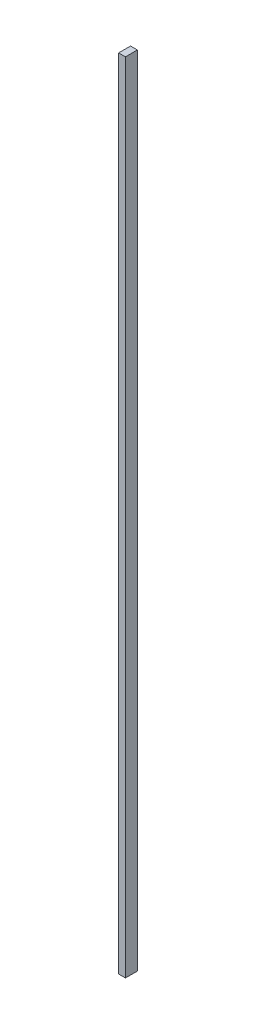
ISO-10303-21;
HEADER;
FILE_DESCRIPTION(('STEP AP214'),'2;1');
FILE_NAME('part.step','',(''),(''),'','','');
FILE_SCHEMA(('AUTOMOTIVE_DESIGN { 1 0 10303 214 1 1 1 1 }'));
ENDSEC;
DATA;
#1=APPLICATION_CONTEXT('core data for automotive mechanical design processes');
#2=APPLICATION_PROTOCOL_DEFINITION('international standard','automotive_design',2000,#1);
#3=PRODUCT_CONTEXT('',#1,'mechanical');
#4=PRODUCT('Part','Part','',(#3));
#5=PRODUCT_RELATED_PRODUCT_CATEGORY('part','',(#4));
#6=PRODUCT_DEFINITION_FORMATION('','',#4);
#7=PRODUCT_DEFINITION_CONTEXT('part definition',#1,'design');
#8=PRODUCT_DEFINITION('design','',#6,#7);
#9=PRODUCT_DEFINITION_SHAPE('','',#8);
#10=(LENGTH_UNIT() NAMED_UNIT(*) SI_UNIT(.MILLI.,.METRE.));
#11=(NAMED_UNIT(*) PLANE_ANGLE_UNIT() SI_UNIT($,.RADIAN.));
#12=(NAMED_UNIT(*) SI_UNIT($,.STERADIAN.) SOLID_ANGLE_UNIT());
#13=UNCERTAINTY_MEASURE_WITH_UNIT(LENGTH_MEASURE(1.E-05),#10,'distance_accuracy_value','');
#14=(GEOMETRIC_REPRESENTATION_CONTEXT(3) GLOBAL_UNCERTAINTY_ASSIGNED_CONTEXT((#13)) GLOBAL_UNIT_ASSIGNED_CONTEXT((#10,
#11,#12)) REPRESENTATION_CONTEXT('',''));
#15=CARTESIAN_POINT('',(0.,0.,0.));
#16=DIRECTION('',(0.,0.,1.));
#17=DIRECTION('',(1.,0.,0.));
#18=AXIS2_PLACEMENT_3D('',#15,#16,#17);
#19=CARTESIAN_POINT('',(124.,117.085786437627,-117.085786437627));
#20=DIRECTION('',(0.,0.,-1.));
#21=DIRECTION('',(0.,1.,0.));
#22=AXIS2_PLACEMENT_3D('',#19,#20,#21);
#23=PLANE('',#22);
#24=DIRECTION('',(0.,-1.,0.));
#25=VECTOR('',#24,1.);
#26=CARTESIAN_POINT('',(122.,117.085786437627,-117.085786437627));
#27=LINE('',#26,#25);
#28=CARTESIAN_POINT('',(122.,117.085786437627,-117.085786437627));
#29=VERTEX_POINT('',#28);
#30=CARTESIAN_POINT('',(122.,-117.085786437627,-117.085786437627));
#31=VERTEX_POINT('',#30);
#32=EDGE_CURVE('E107',#29,#31,#27,.T.);
#33=ORIENTED_EDGE('',*,*,#32,.T.);
#34=DIRECTION('',(-1.,0.,0.));
#35=VECTOR('',#34,1.);
#36=CARTESIAN_POINT('',(124.,-117.085786437627,-117.085786437627));
#37=LINE('',#36,#35);
#38=CARTESIAN_POINT('',(124.,-117.085786437627,-117.085786437627));
#39=VERTEX_POINT('',#38);
#40=EDGE_CURVE('E11',#39,#31,#37,.T.);
#41=ORIENTED_EDGE('',*,*,#40,.F.);
#42=DIRECTION('',(0.,-1.,0.));
#43=VECTOR('',#42,1.);
#44=CARTESIAN_POINT('',(124.,117.085786437627,-117.085786437627));
#45=LINE('',#44,#43);
#46=CARTESIAN_POINT('',(124.,117.085786437627,-117.085786437627));
#47=VERTEX_POINT('',#46);
#48=EDGE_CURVE('E91',#47,#39,#45,.T.);
#49=ORIENTED_EDGE('',*,*,#48,.F.);
#50=DIRECTION('',(-1.,0.,0.));
#51=VECTOR('',#50,1.);
#52=CARTESIAN_POINT('',(124.,117.085786437627,-117.085786437627));
#53=LINE('',#52,#51);
#54=EDGE_CURVE('E103',#47,#29,#53,.T.);
#55=ORIENTED_EDGE('',*,*,#54,.T.);
#56=EDGE_LOOP('',(#33,#41,#49,#55));
#57=FACE_BOUND('',#56,.T.);
#58=ADVANCED_FACE('F39',(#57),#23,.F.);
#59=CARTESIAN_POINT('',(124.,-117.085786437627,-117.085786437627));
#60=DIRECTION('',(0.,1.,0.));
#61=DIRECTION('',(0.,0.,1.));
#62=AXIS2_PLACEMENT_3D('',#59,#60,#61);
#63=PLANE('',#62);
#64=DIRECTION('',(0.,0.,-1.));
#65=VECTOR('',#64,1.);
#66=CARTESIAN_POINT('',(122.,-117.085786437627,-117.085786437627));
#67=LINE('',#66,#65);
#68=CARTESIAN_POINT('',(122.,-117.085786437627,-120.585786437627));
#69=VERTEX_POINT('',#68);
#70=EDGE_CURVE('E96',#31,#69,#67,.T.);
#71=ORIENTED_EDGE('',*,*,#70,.T.);
#72=DIRECTION('',(-1.,0.,0.));
#73=VECTOR('',#72,1.);
#74=CARTESIAN_POINT('',(124.,-117.085786437627,-120.585786437627));
#75=LINE('',#74,#73);
#76=CARTESIAN_POINT('',(124.,-117.085786437627,-120.585786437627));
#77=VERTEX_POINT('',#76);
#78=EDGE_CURVE('E48',#77,#69,#75,.T.);
#79=ORIENTED_EDGE('',*,*,#78,.F.);
#80=DIRECTION('',(0.,0.,-1.));
#81=VECTOR('',#80,1.);
#82=CARTESIAN_POINT('',(124.,-117.085786437627,-117.085786437627));
#83=LINE('',#82,#81);
#84=EDGE_CURVE('E86',#39,#77,#83,.T.);
#85=ORIENTED_EDGE('',*,*,#84,.F.);
#86=ORIENTED_EDGE('',*,*,#40,.T.);
#87=EDGE_LOOP('',(#71,#79,#85,#86));
#88=FACE_BOUND('',#87,.T.);
#89=ADVANCED_FACE('F95',(#88),#63,.F.);
#90=CARTESIAN_POINT('',(124.,117.085786437627,-120.585786437627));
#91=DIRECTION('',(0.,0.,1.));
#92=DIRECTION('',(0.,-1.,0.));
#93=AXIS2_PLACEMENT_3D('',#90,#91,#92);
#94=PLANE('',#93);
#95=DIRECTION('',(0.,1.,0.));
#96=VECTOR('',#95,1.);
#97=CARTESIAN_POINT('',(122.,117.085786437627,-120.585786437627));
#98=LINE('',#97,#96);
#99=CARTESIAN_POINT('',(122.,117.085786437627,-120.585786437627));
#100=VERTEX_POINT('',#99);
#101=EDGE_CURVE('E73',#69,#100,#98,.T.);
#102=ORIENTED_EDGE('',*,*,#101,.T.);
#103=DIRECTION('',(-1.,0.,0.));
#104=VECTOR('',#103,1.);
#105=CARTESIAN_POINT('',(124.,117.085786437627,-120.585786437627));
#106=LINE('',#105,#104);
#107=CARTESIAN_POINT('',(124.,117.085786437627,-120.585786437627));
#108=VERTEX_POINT('',#107);
#109=EDGE_CURVE('E98',#108,#100,#106,.T.);
#110=ORIENTED_EDGE('',*,*,#109,.F.);
#111=DIRECTION('',(0.,1.,0.));
#112=VECTOR('',#111,1.);
#113=CARTESIAN_POINT('',(124.,117.085786437627,-120.585786437627));
#114=LINE('',#113,#112);
#115=EDGE_CURVE('E89',#77,#108,#114,.T.);
#116=ORIENTED_EDGE('',*,*,#115,.F.);
#117=ORIENTED_EDGE('',*,*,#78,.T.);
#118=EDGE_LOOP('',(#102,#110,#116,#117));
#119=FACE_BOUND('',#118,.T.);
#120=ADVANCED_FACE('F99',(#119),#94,.F.);
#121=CARTESIAN_POINT('',(124.,117.085786437627,-117.085786437627));
#122=DIRECTION('',(0.,-1.,0.));
#123=DIRECTION('',(0.,0.,-1.));
#124=AXIS2_PLACEMENT_3D('',#121,#122,#123);
#125=PLANE('',#124);
#126=DIRECTION('',(0.,0.,1.));
#127=VECTOR('',#126,1.);
#128=CARTESIAN_POINT('',(122.,117.085786437627,-117.085786437627));
#129=LINE('',#128,#127);
#130=EDGE_CURVE('E79',#100,#29,#129,.T.);
#131=ORIENTED_EDGE('',*,*,#130,.T.);
#132=ORIENTED_EDGE('',*,*,#54,.F.);
#133=DIRECTION('',(0.,0.,1.));
#134=VECTOR('',#133,1.);
#135=CARTESIAN_POINT('',(124.,117.085786437627,-117.085786437627));
#136=LINE('',#135,#134);
#137=EDGE_CURVE('E56',#108,#47,#136,.T.);
#138=ORIENTED_EDGE('',*,*,#137,.F.);
#139=ORIENTED_EDGE('',*,*,#109,.T.);
#140=EDGE_LOOP('',(#131,#132,#138,#139));
#141=FACE_BOUND('',#140,.T.);
#142=ADVANCED_FACE('F120',(#141),#125,.F.);
#143=CARTESIAN_POINT('',(124.,0.,0.));
#144=DIRECTION('',(1.,0.,0.));
#145=DIRECTION('',(0.,0.,-1.));
#146=AXIS2_PLACEMENT_3D('',#143,#144,#145);
#147=PLANE('',#146);
#148=ORIENTED_EDGE('',*,*,#48,.T.);
#149=ORIENTED_EDGE('',*,*,#84,.T.);
#150=ORIENTED_EDGE('',*,*,#115,.T.);
#151=ORIENTED_EDGE('',*,*,#137,.T.);
#152=EDGE_LOOP('',(#148,#149,#150,#151));
#153=FACE_BOUND('',#152,.T.);
#154=ADVANCED_FACE('F87',(#153),#147,.T.);
#155=CARTESIAN_POINT('',(122.,0.,0.));
#156=DIRECTION('',(1.,0.,0.));
#157=DIRECTION('',(0.,0.,-1.));
#158=AXIS2_PLACEMENT_3D('',#155,#156,#157);
#159=PLANE('',#158);
#160=ORIENTED_EDGE('',*,*,#32,.F.);
#161=ORIENTED_EDGE('',*,*,#130,.F.);
#162=ORIENTED_EDGE('',*,*,#101,.F.);
#163=ORIENTED_EDGE('',*,*,#70,.F.);
#164=EDGE_LOOP('',(#160,#161,#162,#163));
#165=FACE_BOUND('',#164,.T.);
#166=ADVANCED_FACE('F123',(#165),#159,.F.);
#167=CLOSED_SHELL('',(#58,#89,#120,#142,#154,#166));
#168=MANIFOLD_SOLID_BREP('B2',#167);
#169=ADVANCED_BREP_SHAPE_REPRESENTATION('',(#18,#168),#14);
#170=SHAPE_DEFINITION_REPRESENTATION(#9,#169);
ENDSEC;
END-ISO-10303-21;
